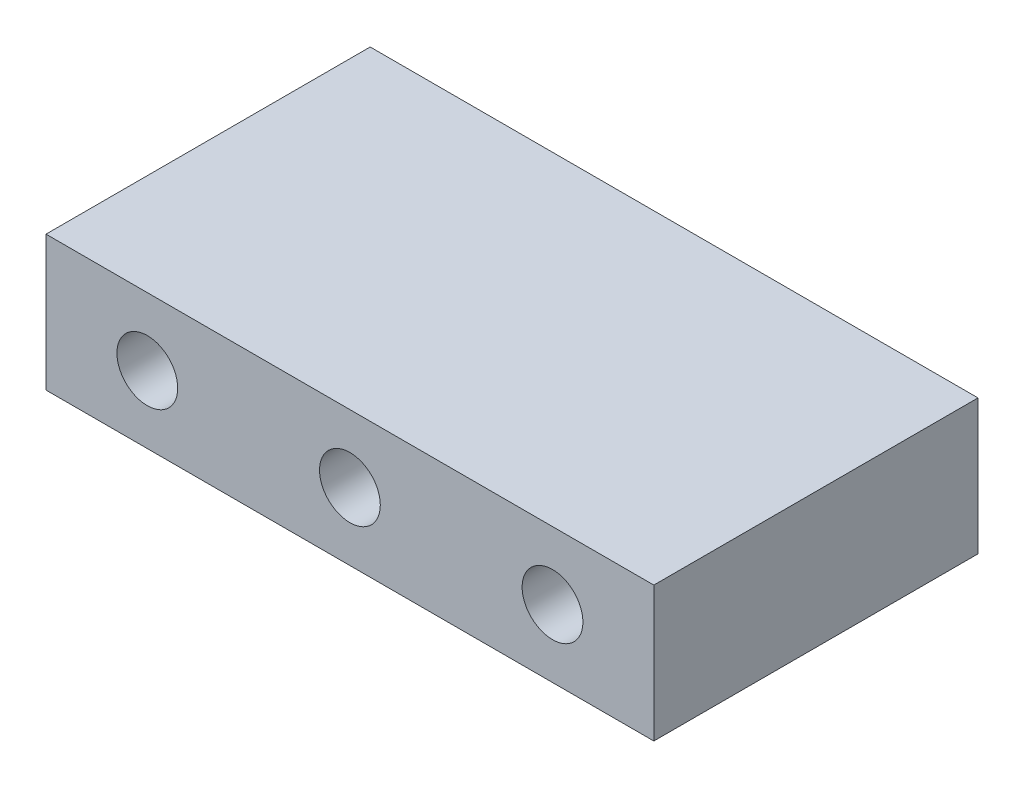
ISO-10303-21;
HEADER;
FILE_DESCRIPTION(('STEP AP214'),'2;1');
FILE_NAME('part.step','',(''),(''),'','','');
FILE_SCHEMA(('AUTOMOTIVE_DESIGN { 1 0 10303 214 1 1 1 1 }'));
ENDSEC;
DATA;
#1=APPLICATION_CONTEXT('core data for automotive mechanical design processes');
#2=APPLICATION_PROTOCOL_DEFINITION('international standard','automotive_design',2000,#1);
#3=PRODUCT_CONTEXT('',#1,'mechanical');
#4=PRODUCT('Part','Part','',(#3));
#5=PRODUCT_RELATED_PRODUCT_CATEGORY('part','',(#4));
#6=PRODUCT_DEFINITION_FORMATION('','',#4);
#7=PRODUCT_DEFINITION_CONTEXT('part definition',#1,'design');
#8=PRODUCT_DEFINITION('design','',#6,#7);
#9=PRODUCT_DEFINITION_SHAPE('','',#8);
#10=(LENGTH_UNIT() NAMED_UNIT(*) SI_UNIT(.MILLI.,.METRE.));
#11=(NAMED_UNIT(*) PLANE_ANGLE_UNIT() SI_UNIT($,.RADIAN.));
#12=(NAMED_UNIT(*) SI_UNIT($,.STERADIAN.) SOLID_ANGLE_UNIT());
#13=UNCERTAINTY_MEASURE_WITH_UNIT(LENGTH_MEASURE(1.E-05),#10,'distance_accuracy_value','');
#14=(GEOMETRIC_REPRESENTATION_CONTEXT(3) GLOBAL_UNCERTAINTY_ASSIGNED_CONTEXT((#13)) GLOBAL_UNIT_ASSIGNED_CONTEXT((#10,
#11,#12)) REPRESENTATION_CONTEXT('',''));
#15=CARTESIAN_POINT('',(0.,0.,0.));
#16=DIRECTION('',(0.,0.,1.));
#17=DIRECTION('',(1.,0.,0.));
#18=AXIS2_PLACEMENT_3D('',#15,#16,#17);
#19=CARTESIAN_POINT('',(0.,0.,48.));
#20=DIRECTION('',(0.,0.,1.));
#21=DIRECTION('',(1.,0.,0.));
#22=AXIS2_PLACEMENT_3D('',#19,#20,#21);
#23=PLANE('',#22);
#24=CARTESIAN_POINT('',(0.,0.,48.));
#25=DIRECTION('',(0.,0.,1.));
#26=DIRECTION('',(1.,0.,0.));
#27=AXIS2_PLACEMENT_3D('',#24,#25,#26);
#28=CIRCLE('',#27,4.5);
#29=CARTESIAN_POINT('',(4.49999999999999,0.,48.));
#30=VERTEX_POINT('',#29);
#31=EDGE_CURVE('E119',#30,#30,#28,.T.);
#32=ORIENTED_EDGE('',*,*,#31,.F.);
#33=EDGE_LOOP('',(#32));
#34=FACE_BOUND('',#33,.T.);
#35=DIRECTION('',(0.,1.,0.));
#36=VECTOR('',#35,1.);
#37=CARTESIAN_POINT('',(45.,10.,48.));
#38=LINE('',#37,#36);
#39=CARTESIAN_POINT('',(45.,-10.,48.));
#40=VERTEX_POINT('',#39);
#41=CARTESIAN_POINT('',(45.,10.,48.));
#42=VERTEX_POINT('',#41);
#43=EDGE_CURVE('E89',#40,#42,#38,.T.);
#44=ORIENTED_EDGE('',*,*,#43,.T.);
#45=DIRECTION('',(-1.,0.,0.));
#46=VECTOR('',#45,1.);
#47=CARTESIAN_POINT('',(-45.,10.,48.));
#48=LINE('',#47,#46);
#49=CARTESIAN_POINT('',(-45.,10.,48.));
#50=VERTEX_POINT('',#49);
#51=EDGE_CURVE('E84',#42,#50,#48,.T.);
#52=ORIENTED_EDGE('',*,*,#51,.T.);
#53=DIRECTION('',(0.,-1.,0.));
#54=VECTOR('',#53,1.);
#55=CARTESIAN_POINT('',(-45.,10.,48.));
#56=LINE('',#55,#54);
#57=CARTESIAN_POINT('',(-45.,-10.,48.));
#58=VERTEX_POINT('',#57);
#59=EDGE_CURVE('E87',#50,#58,#56,.T.);
#60=ORIENTED_EDGE('',*,*,#59,.T.);
#61=DIRECTION('',(1.,0.,0.));
#62=VECTOR('',#61,1.);
#63=CARTESIAN_POINT('',(-45.,-10.,48.));
#64=LINE('',#63,#62);
#65=EDGE_CURVE('E54',#58,#40,#64,.T.);
#66=ORIENTED_EDGE('',*,*,#65,.T.);
#67=EDGE_LOOP('',(#44,#52,#60,#66));
#68=FACE_BOUND('',#67,.T.);
#69=CARTESIAN_POINT('',(-30.,0.,48.));
#70=DIRECTION('',(0.,0.,1.));
#71=DIRECTION('',(1.,0.,0.));
#72=AXIS2_PLACEMENT_3D('',#69,#70,#71);
#73=CIRCLE('',#72,4.5);
#74=CARTESIAN_POINT('',(-25.5,0.,48.));
#75=VERTEX_POINT('',#74);
#76=EDGE_CURVE('E104',#75,#75,#73,.T.);
#77=ORIENTED_EDGE('',*,*,#76,.F.);
#78=EDGE_LOOP('',(#77));
#79=FACE_BOUND('',#78,.T.);
#80=CARTESIAN_POINT('',(30.,0.,48.));
#81=DIRECTION('',(0.,0.,1.));
#82=DIRECTION('',(1.,0.,0.));
#83=AXIS2_PLACEMENT_3D('',#80,#81,#82);
#84=CIRCLE('',#83,4.5);
#85=CARTESIAN_POINT('',(34.5,0.,48.));
#86=VERTEX_POINT('',#85);
#87=EDGE_CURVE('E125',#86,#86,#84,.T.);
#88=ORIENTED_EDGE('',*,*,#87,.F.);
#89=EDGE_LOOP('',(#88));
#90=FACE_BOUND('',#89,.T.);
#91=ADVANCED_FACE('F37',(#34,#68,#79,#90),#23,.T.);
#92=CARTESIAN_POINT('',(0.,0.,0.));
#93=DIRECTION('',(0.,0.,1.));
#94=DIRECTION('',(1.,0.,0.));
#95=AXIS2_PLACEMENT_3D('',#92,#93,#94);
#96=PLANE('',#95);
#97=DIRECTION('',(0.,1.,0.));
#98=VECTOR('',#97,1.);
#99=CARTESIAN_POINT('',(45.,10.,0.));
#100=LINE('',#99,#98);
#101=CARTESIAN_POINT('',(45.,-10.,0.));
#102=VERTEX_POINT('',#101);
#103=CARTESIAN_POINT('',(45.,10.,0.));
#104=VERTEX_POINT('',#103);
#105=EDGE_CURVE('E101',#102,#104,#100,.T.);
#106=ORIENTED_EDGE('',*,*,#105,.F.);
#107=DIRECTION('',(1.,0.,0.));
#108=VECTOR('',#107,1.);
#109=CARTESIAN_POINT('',(-45.,-10.,0.));
#110=LINE('',#109,#108);
#111=CARTESIAN_POINT('',(-45.,-10.,0.));
#112=VERTEX_POINT('',#111);
#113=EDGE_CURVE('E77',#112,#102,#110,.T.);
#114=ORIENTED_EDGE('',*,*,#113,.F.);
#115=DIRECTION('',(0.,-1.,0.));
#116=VECTOR('',#115,1.);
#117=CARTESIAN_POINT('',(-45.,10.,0.));
#118=LINE('',#117,#116);
#119=CARTESIAN_POINT('',(-45.,10.,0.));
#120=VERTEX_POINT('',#119);
#121=EDGE_CURVE('E71',#120,#112,#118,.T.);
#122=ORIENTED_EDGE('',*,*,#121,.F.);
#123=DIRECTION('',(-1.,0.,0.));
#124=VECTOR('',#123,1.);
#125=CARTESIAN_POINT('',(-45.,10.,0.));
#126=LINE('',#125,#124);
#127=EDGE_CURVE('E93',#104,#120,#126,.T.);
#128=ORIENTED_EDGE('',*,*,#127,.F.);
#129=EDGE_LOOP('',(#106,#114,#122,#128));
#130=FACE_BOUND('',#129,.T.);
#131=CARTESIAN_POINT('',(-30.,0.,0.));
#132=DIRECTION('',(0.,0.,1.));
#133=DIRECTION('',(1.,0.,0.));
#134=AXIS2_PLACEMENT_3D('',#131,#132,#133);
#135=CIRCLE('',#134,4.5);
#136=CARTESIAN_POINT('',(-25.5,0.,0.));
#137=VERTEX_POINT('',#136);
#138=EDGE_CURVE('E116',#137,#137,#135,.T.);
#139=ORIENTED_EDGE('',*,*,#138,.T.);
#140=EDGE_LOOP('',(#139));
#141=FACE_BOUND('',#140,.T.);
#142=CARTESIAN_POINT('',(0.,0.,0.));
#143=DIRECTION('',(0.,0.,1.));
#144=DIRECTION('',(1.,0.,0.));
#145=AXIS2_PLACEMENT_3D('',#142,#143,#144);
#146=CIRCLE('',#145,4.5);
#147=CARTESIAN_POINT('',(4.49999999999999,0.,0.));
#148=VERTEX_POINT('',#147);
#149=EDGE_CURVE('E122',#148,#148,#146,.T.);
#150=ORIENTED_EDGE('',*,*,#149,.T.);
#151=EDGE_LOOP('',(#150));
#152=FACE_BOUND('',#151,.T.);
#153=CARTESIAN_POINT('',(30.,0.,0.));
#154=DIRECTION('',(0.,0.,1.));
#155=DIRECTION('',(1.,0.,0.));
#156=AXIS2_PLACEMENT_3D('',#153,#154,#155);
#157=CIRCLE('',#156,4.5);
#158=CARTESIAN_POINT('',(34.5,0.,0.));
#159=VERTEX_POINT('',#158);
#160=EDGE_CURVE('E128',#159,#159,#157,.T.);
#161=ORIENTED_EDGE('',*,*,#160,.T.);
#162=EDGE_LOOP('',(#161));
#163=FACE_BOUND('',#162,.T.);
#164=ADVANCED_FACE('F112',(#130,#141,#152,#163),#96,.F.);
#165=CARTESIAN_POINT('',(45.,10.,48.));
#166=DIRECTION('',(-1.,0.,0.));
#167=DIRECTION('',(0.,0.,1.));
#168=AXIS2_PLACEMENT_3D('',#165,#166,#167);
#169=PLANE('',#168);
#170=ORIENTED_EDGE('',*,*,#105,.T.);
#171=DIRECTION('',(0.,0.,-1.));
#172=VECTOR('',#171,1.);
#173=CARTESIAN_POINT('',(45.,10.,48.));
#174=LINE('',#173,#172);
#175=EDGE_CURVE('E11',#42,#104,#174,.T.);
#176=ORIENTED_EDGE('',*,*,#175,.F.);
#177=ORIENTED_EDGE('',*,*,#43,.F.);
#178=DIRECTION('',(0.,0.,-1.));
#179=VECTOR('',#178,1.);
#180=CARTESIAN_POINT('',(45.,-10.,48.));
#181=LINE('',#180,#179);
#182=EDGE_CURVE('E97',#40,#102,#181,.T.);
#183=ORIENTED_EDGE('',*,*,#182,.T.);
#184=EDGE_LOOP('',(#170,#176,#177,#183));
#185=FACE_BOUND('',#184,.T.);
#186=ADVANCED_FACE('F39',(#185),#169,.F.);
#187=CARTESIAN_POINT('',(-45.,10.,48.));
#188=DIRECTION('',(0.,-1.,0.));
#189=DIRECTION('',(1.,0.,0.));
#190=AXIS2_PLACEMENT_3D('',#187,#188,#189);
#191=PLANE('',#190);
#192=ORIENTED_EDGE('',*,*,#127,.T.);
#193=DIRECTION('',(0.,0.,-1.));
#194=VECTOR('',#193,1.);
#195=CARTESIAN_POINT('',(-45.,10.,48.));
#196=LINE('',#195,#194);
#197=EDGE_CURVE('E46',#50,#120,#196,.T.);
#198=ORIENTED_EDGE('',*,*,#197,.F.);
#199=ORIENTED_EDGE('',*,*,#51,.F.);
#200=ORIENTED_EDGE('',*,*,#175,.T.);
#201=EDGE_LOOP('',(#192,#198,#199,#200));
#202=FACE_BOUND('',#201,.T.);
#203=ADVANCED_FACE('F92',(#202),#191,.F.);
#204=CARTESIAN_POINT('',(-45.,10.,48.));
#205=DIRECTION('',(1.,0.,0.));
#206=DIRECTION('',(0.,0.,-1.));
#207=AXIS2_PLACEMENT_3D('',#204,#205,#206);
#208=PLANE('',#207);
#209=ORIENTED_EDGE('',*,*,#121,.T.);
#210=DIRECTION('',(0.,0.,-1.));
#211=VECTOR('',#210,1.);
#212=CARTESIAN_POINT('',(-45.,-10.,48.));
#213=LINE('',#212,#211);
#214=EDGE_CURVE('E94',#58,#112,#213,.T.);
#215=ORIENTED_EDGE('',*,*,#214,.F.);
#216=ORIENTED_EDGE('',*,*,#59,.F.);
#217=ORIENTED_EDGE('',*,*,#197,.T.);
#218=EDGE_LOOP('',(#209,#215,#216,#217));
#219=FACE_BOUND('',#218,.T.);
#220=ADVANCED_FACE('F95',(#219),#208,.F.);
#221=CARTESIAN_POINT('',(-45.,-10.,48.));
#222=DIRECTION('',(0.,1.,0.));
#223=DIRECTION('',(0.,0.,1.));
#224=AXIS2_PLACEMENT_3D('',#221,#222,#223);
#225=PLANE('',#224);
#226=ORIENTED_EDGE('',*,*,#113,.T.);
#227=ORIENTED_EDGE('',*,*,#182,.F.);
#228=ORIENTED_EDGE('',*,*,#65,.F.);
#229=ORIENTED_EDGE('',*,*,#214,.T.);
#230=EDGE_LOOP('',(#226,#227,#228,#229));
#231=FACE_BOUND('',#230,.T.);
#232=ADVANCED_FACE('F109',(#231),#225,.F.);
#233=CARTESIAN_POINT('',(-30.,0.,48.));
#234=DIRECTION('',(0.,0.,-1.));
#235=DIRECTION('',(-1.,0.,0.));
#236=AXIS2_PLACEMENT_3D('',#233,#234,#235);
#237=CYLINDRICAL_SURFACE('',#236,4.5);
#238=ORIENTED_EDGE('',*,*,#76,.T.);
#239=EDGE_LOOP('',(#238));
#240=FACE_BOUND('',#239,.T.);
#241=ORIENTED_EDGE('',*,*,#138,.F.);
#242=EDGE_LOOP('',(#241));
#243=FACE_BOUND('',#242,.T.);
#244=ADVANCED_FACE('F146',(#240,#243),#237,.F.);
#245=CARTESIAN_POINT('',(0.,0.,48.));
#246=DIRECTION('',(0.,0.,-1.));
#247=DIRECTION('',(-1.,0.,0.));
#248=AXIS2_PLACEMENT_3D('',#245,#246,#247);
#249=CYLINDRICAL_SURFACE('',#248,4.5);
#250=ORIENTED_EDGE('',*,*,#31,.T.);
#251=EDGE_LOOP('',(#250));
#252=FACE_BOUND('',#251,.T.);
#253=ORIENTED_EDGE('',*,*,#149,.F.);
#254=EDGE_LOOP('',(#253));
#255=FACE_BOUND('',#254,.T.);
#256=ADVANCED_FACE('F200',(#252,#255),#249,.F.);
#257=CARTESIAN_POINT('',(30.,0.,48.));
#258=DIRECTION('',(0.,0.,-1.));
#259=DIRECTION('',(-1.,0.,0.));
#260=AXIS2_PLACEMENT_3D('',#257,#258,#259);
#261=CYLINDRICAL_SURFACE('',#260,4.5);
#262=ORIENTED_EDGE('',*,*,#87,.T.);
#263=EDGE_LOOP('',(#262));
#264=FACE_BOUND('',#263,.T.);
#265=ORIENTED_EDGE('',*,*,#160,.F.);
#266=EDGE_LOOP('',(#265));
#267=FACE_BOUND('',#266,.T.);
#268=ADVANCED_FACE('F134',(#264,#267),#261,.F.);
#269=CLOSED_SHELL('',(#91,#164,#186,#203,#220,#232,#244,#256,#268));
#270=MANIFOLD_SOLID_BREP('B2',#269);
#271=ADVANCED_BREP_SHAPE_REPRESENTATION('',(#18,#270),#14);
#272=SHAPE_DEFINITION_REPRESENTATION(#9,#271);
ENDSEC;
END-ISO-10303-21;
